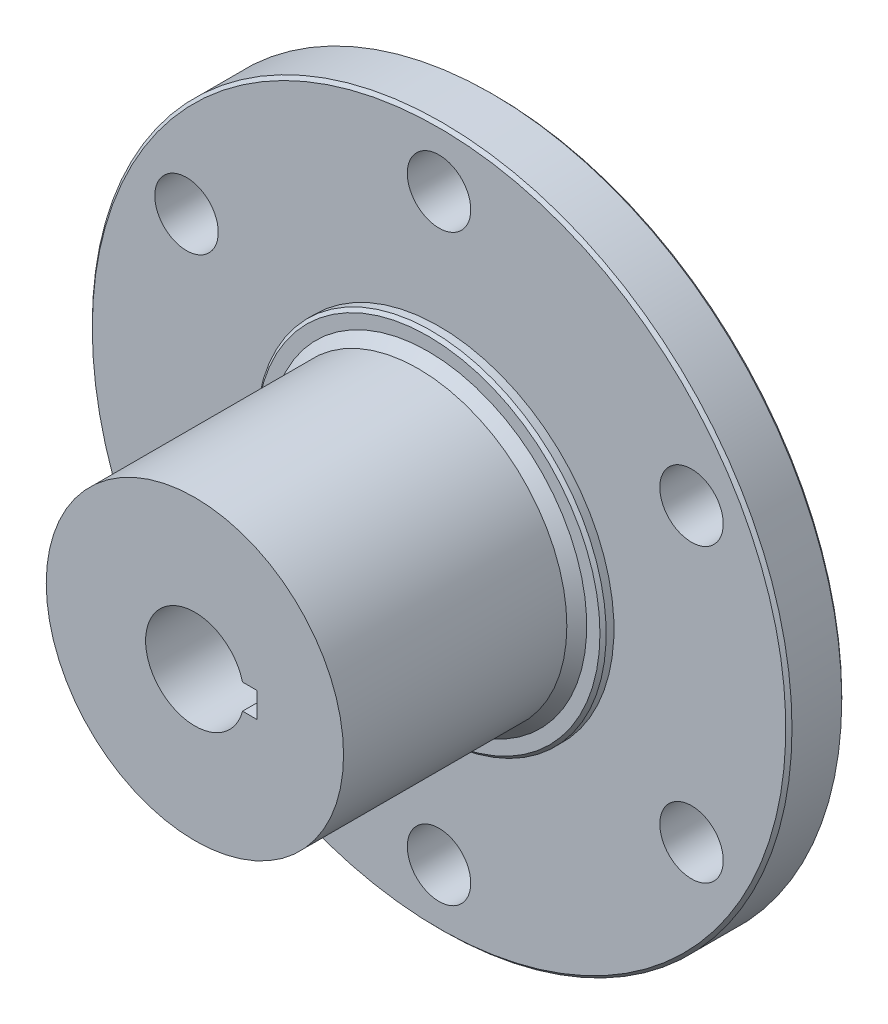
ISO-10303-21;
HEADER;
FILE_DESCRIPTION(('STEP AP214'),'2;1');
FILE_NAME('part.step','',(''),(''),'','','');
FILE_SCHEMA(('AUTOMOTIVE_DESIGN { 1 0 10303 214 1 1 1 1 }'));
ENDSEC;
DATA;
#1=APPLICATION_CONTEXT('core data for automotive mechanical design processes');
#2=APPLICATION_PROTOCOL_DEFINITION('international standard','automotive_design',2000,#1);
#3=PRODUCT_CONTEXT('',#1,'mechanical');
#4=PRODUCT('Part','Part','',(#3));
#5=PRODUCT_RELATED_PRODUCT_CATEGORY('part','',(#4));
#6=PRODUCT_DEFINITION_FORMATION('','',#4);
#7=PRODUCT_DEFINITION_CONTEXT('part definition',#1,'design');
#8=PRODUCT_DEFINITION('design','',#6,#7);
#9=PRODUCT_DEFINITION_SHAPE('','',#8);
#10=(LENGTH_UNIT() NAMED_UNIT(*) SI_UNIT(.MILLI.,.METRE.));
#11=(NAMED_UNIT(*) PLANE_ANGLE_UNIT() SI_UNIT($,.RADIAN.));
#12=(NAMED_UNIT(*) SI_UNIT($,.STERADIAN.) SOLID_ANGLE_UNIT());
#13=UNCERTAINTY_MEASURE_WITH_UNIT(LENGTH_MEASURE(1.E-05),#10,'distance_accuracy_value','');
#14=(GEOMETRIC_REPRESENTATION_CONTEXT(3) GLOBAL_UNCERTAINTY_ASSIGNED_CONTEXT((#13)) GLOBAL_UNIT_ASSIGNED_CONTEXT((#10,
#11,#12)) REPRESENTATION_CONTEXT('',''));
#15=CARTESIAN_POINT('',(0.,0.,0.));
#16=DIRECTION('',(0.,0.,1.));
#17=DIRECTION('',(1.,0.,0.));
#18=AXIS2_PLACEMENT_3D('',#15,#16,#17);
#19=CARTESIAN_POINT('',(3.89225476041844,-1.0287,0.));
#20=DIRECTION('',(0.,-1.,0.));
#21=DIRECTION('',(1.,0.,0.));
#22=AXIS2_PLACEMENT_3D('',#19,#20,#21);
#23=PLANE('',#22);
#24=DIRECTION('',(0.,0.,-1.));
#25=VECTOR('',#24,1.);
#26=CARTESIAN_POINT('',(5.0546,-1.0287,0.));
#27=LINE('',#26,#25);
#28=CARTESIAN_POINT('',(5.0546,-1.0287,25.4));
#29=VERTEX_POINT('',#28);
#30=CARTESIAN_POINT('',(5.0546,-1.0287,0.));
#31=VERTEX_POINT('',#30);
#32=EDGE_CURVE('E78',#29,#31,#27,.T.);
#33=ORIENTED_EDGE('',*,*,#32,.T.);
#34=DIRECTION('',(1.,0.,0.));
#35=VECTOR('',#34,1.);
#36=CARTESIAN_POINT('',(3.89225476041844,-1.0287,0.));
#37=LINE('',#36,#35);
#38=CARTESIAN_POINT('',(3.89225476041844,-1.0287,0.));
#39=VERTEX_POINT('',#38);
#40=EDGE_CURVE('E35',#39,#31,#37,.T.);
#41=ORIENTED_EDGE('',*,*,#40,.F.);
#42=DIRECTION('',(0.,0.,1.));
#43=VECTOR('',#42,1.);
#44=CARTESIAN_POINT('',(3.89225476041844,-1.0287,0.));
#45=LINE('',#44,#43);
#46=CARTESIAN_POINT('',(3.89225476041844,-1.0287,25.4));
#47=VERTEX_POINT('',#46);
#48=EDGE_CURVE('E67',#39,#47,#45,.T.);
#49=ORIENTED_EDGE('',*,*,#48,.T.);
#50=DIRECTION('',(1.,0.,0.));
#51=VECTOR('',#50,1.);
#52=CARTESIAN_POINT('',(0.,-1.0287,25.4));
#53=LINE('',#52,#51);
#54=EDGE_CURVE('E53',#29,#47,#53,.F.);
#55=ORIENTED_EDGE('',*,*,#54,.F.);
#56=EDGE_LOOP('',(#33,#41,#49,#55));
#57=FACE_BOUND('',#56,.T.);
#58=ADVANCED_FACE('F17',(#57),#23,.F.);
#59=CARTESIAN_POINT('',(3.89225476041844,1.0287,0.));
#60=DIRECTION('',(0.,1.,0.));
#61=DIRECTION('',(0.,0.,1.));
#62=AXIS2_PLACEMENT_3D('',#59,#60,#61);
#63=PLANE('',#62);
#64=DIRECTION('',(0.,0.,1.));
#65=VECTOR('',#64,1.);
#66=CARTESIAN_POINT('',(3.89225476041844,1.0287,0.));
#67=LINE('',#66,#65);
#68=CARTESIAN_POINT('',(3.89225476041844,1.0287,25.4));
#69=VERTEX_POINT('',#68);
#70=CARTESIAN_POINT('',(3.89225476041844,1.0287,0.));
#71=VERTEX_POINT('',#70);
#72=EDGE_CURVE('E60',#69,#71,#67,.F.);
#73=ORIENTED_EDGE('',*,*,#72,.T.);
#74=DIRECTION('',(1.,0.,0.));
#75=VECTOR('',#74,1.);
#76=CARTESIAN_POINT('',(3.89225476041844,1.0287,0.));
#77=LINE('',#76,#75);
#78=CARTESIAN_POINT('',(5.0546,1.0287,0.));
#79=VERTEX_POINT('',#78);
#80=EDGE_CURVE('E87',#79,#71,#77,.F.);
#81=ORIENTED_EDGE('',*,*,#80,.F.);
#82=DIRECTION('',(0.,0.,-1.));
#83=VECTOR('',#82,1.);
#84=CARTESIAN_POINT('',(5.0546,1.0287,0.));
#85=LINE('',#84,#83);
#86=CARTESIAN_POINT('',(5.0546,1.0287,25.4));
#87=VERTEX_POINT('',#86);
#88=EDGE_CURVE('E74',#79,#87,#85,.F.);
#89=ORIENTED_EDGE('',*,*,#88,.T.);
#90=DIRECTION('',(1.,0.,0.));
#91=VECTOR('',#90,1.);
#92=CARTESIAN_POINT('',(0.,1.0287,25.4));
#93=LINE('',#92,#91);
#94=EDGE_CURVE('E68',#69,#87,#93,.T.);
#95=ORIENTED_EDGE('',*,*,#94,.F.);
#96=EDGE_LOOP('',(#73,#81,#89,#95));
#97=FACE_BOUND('',#96,.T.);
#98=ADVANCED_FACE('F72',(#97),#63,.F.);
#99=CARTESIAN_POINT('',(0.,0.,25.4));
#100=DIRECTION('',(0.,0.,1.));
#101=DIRECTION('',(1.,0.,0.));
#102=AXIS2_PLACEMENT_3D('',#99,#100,#101);
#103=PLANE('',#102);
#104=CARTESIAN_POINT('',(0.,0.,25.4));
#105=DIRECTION('',(0.,0.,-1.));
#106=DIRECTION('',(-1.,0.,0.));
#107=AXIS2_PLACEMENT_3D('',#104,#105,#106);
#108=CIRCLE('',#107,12.1412);
#109=CARTESIAN_POINT('',(-12.1412,0.,25.4));
#110=VERTEX_POINT('',#109);
#111=EDGE_CURVE('E98',#110,#110,#108,.T.);
#112=ORIENTED_EDGE('',*,*,#111,.F.);
#113=EDGE_LOOP('',(#112));
#114=FACE_BOUND('',#113,.T.);
#115=CARTESIAN_POINT('',(0.,0.,25.4));
#116=DIRECTION('',(0.,0.,1.));
#117=DIRECTION('',(1.,0.,0.));
#118=AXIS2_PLACEMENT_3D('',#115,#116,#117);
#119=CIRCLE('',#118,4.0259);
#120=EDGE_CURVE('E20',#47,#69,#119,.F.);
#121=ORIENTED_EDGE('',*,*,#120,.T.);
#122=ORIENTED_EDGE('',*,*,#94,.T.);
#123=DIRECTION('',(0.,1.,0.));
#124=VECTOR('',#123,1.);
#125=CARTESIAN_POINT('',(5.0546,1.0287,25.4));
#126=LINE('',#125,#124);
#127=EDGE_CURVE('E96',#87,#29,#126,.F.);
#128=ORIENTED_EDGE('',*,*,#127,.T.);
#129=ORIENTED_EDGE('',*,*,#54,.T.);
#130=EDGE_LOOP('',(#121,#122,#128,#129));
#131=FACE_BOUND('',#130,.T.);
#132=ADVANCED_FACE('F77',(#114,#131),#103,.T.);
#133=CARTESIAN_POINT('',(0.,0.,0.));
#134=DIRECTION('',(0.,0.,1.));
#135=DIRECTION('',(1.,0.,0.));
#136=AXIS2_PLACEMENT_3D('',#133,#134,#135);
#137=CYLINDRICAL_SURFACE('',#136,4.0259);
#138=ORIENTED_EDGE('',*,*,#48,.F.);
#139=CARTESIAN_POINT('',(0.,0.,0.));
#140=DIRECTION('',(0.,0.,1.));
#141=DIRECTION('',(1.,0.,0.));
#142=AXIS2_PLACEMENT_3D('',#139,#140,#141);
#143=CIRCLE('',#142,4.0259);
#144=EDGE_CURVE('E65',#39,#71,#143,.F.);
#145=ORIENTED_EDGE('',*,*,#144,.T.);
#146=ORIENTED_EDGE('',*,*,#72,.F.);
#147=ORIENTED_EDGE('',*,*,#120,.F.);
#148=EDGE_LOOP('',(#138,#145,#146,#147));
#149=FACE_BOUND('',#148,.T.);
#150=ADVANCED_FACE('F63',(#149),#137,.F.);
#151=CARTESIAN_POINT('',(5.0546,1.0287,0.));
#152=DIRECTION('',(1.,0.,0.));
#153=DIRECTION('',(0.,0.,-1.));
#154=AXIS2_PLACEMENT_3D('',#151,#152,#153);
#155=PLANE('',#154);
#156=ORIENTED_EDGE('',*,*,#88,.F.);
#157=DIRECTION('',(0.,1.,0.));
#158=VECTOR('',#157,1.);
#159=CARTESIAN_POINT('',(5.0546,0.,0.));
#160=LINE('',#159,#158);
#161=EDGE_CURVE('E106',#79,#31,#160,.F.);
#162=ORIENTED_EDGE('',*,*,#161,.T.);
#163=ORIENTED_EDGE('',*,*,#32,.F.);
#164=ORIENTED_EDGE('',*,*,#127,.F.);
#165=EDGE_LOOP('',(#156,#162,#163,#164));
#166=FACE_BOUND('',#165,.T.);
#167=ADVANCED_FACE('F182',(#166),#155,.F.);
#168=CARTESIAN_POINT('',(0.,0.,25.4));
#169=DIRECTION('',(0.,0.,-1.));
#170=DIRECTION('',(-1.,0.,0.));
#171=AXIS2_PLACEMENT_3D('',#168,#169,#170);
#172=CYLINDRICAL_SURFACE('',#171,12.1412);
#173=ORIENTED_EDGE('',*,*,#111,.T.);
#174=EDGE_LOOP('',(#173));
#175=FACE_BOUND('',#174,.T.);
#176=CARTESIAN_POINT('',(0.,0.,7.16280000000005));
#177=DIRECTION('',(0.,0.,-1.));
#178=DIRECTION('',(-1.,0.,0.));
#179=AXIS2_PLACEMENT_3D('',#176,#177,#178);
#180=CIRCLE('',#179,12.1412);
#181=CARTESIAN_POINT('',(-12.1412,0.,7.16280000000005));
#182=VERTEX_POINT('',#181);
#183=EDGE_CURVE('E109',#182,#182,#180,.T.);
#184=ORIENTED_EDGE('',*,*,#183,.F.);
#185=EDGE_LOOP('',(#184));
#186=FACE_BOUND('',#185,.T.);
#187=ADVANCED_FACE('F172',(#175,#186),#172,.T.);
#188=CARTESIAN_POINT('',(0.,0.,0.));
#189=DIRECTION('',(0.,0.,1.));
#190=DIRECTION('',(1.,0.,0.));
#191=AXIS2_PLACEMENT_3D('',#188,#189,#190);
#192=PLANE('',#191);
#193=ORIENTED_EDGE('',*,*,#161,.F.);
#194=ORIENTED_EDGE('',*,*,#80,.T.);
#195=ORIENTED_EDGE('',*,*,#144,.F.);
#196=ORIENTED_EDGE('',*,*,#40,.T.);
#197=EDGE_LOOP('',(#193,#194,#195,#196));
#198=FACE_BOUND('',#197,.T.);
#199=CARTESIAN_POINT('',(0.,0.,0.));
#200=DIRECTION('',(0.,0.,1.));
#201=DIRECTION('',(0.,-1.,0.));
#202=AXIS2_PLACEMENT_3D('',#199,#200,#201);
#203=CIRCLE('',#202,14.1003226197908);
#204=CARTESIAN_POINT('',(0.,-14.1003226197908,0.));
#205=VERTEX_POINT('',#204);
#206=EDGE_CURVE('E166',#205,#205,#203,.T.);
#207=ORIENTED_EDGE('',*,*,#206,.F.);
#208=EDGE_LOOP('',(#207));
#209=FACE_BOUND('',#208,.T.);
#210=ADVANCED_FACE('F256',(#198,#209),#192,.F.);
#211=CARTESIAN_POINT('',(0.,0.,6.35));
#212=DIRECTION('',(0.,0.,-1.));
#213=DIRECTION('',(0.,1.,0.));
#214=AXIS2_PLACEMENT_3D('',#211,#212,#213);
#215=CONICAL_SURFACE('',#214,12.954,0.785398163397445);
#216=ORIENTED_EDGE('',*,*,#183,.T.);
#217=EDGE_LOOP('',(#216));
#218=FACE_BOUND('',#217,.T.);
#219=CARTESIAN_POINT('',(0.,0.,6.35));
#220=DIRECTION('',(0.,0.,-1.));
#221=DIRECTION('',(0.,1.,0.));
#222=AXIS2_PLACEMENT_3D('',#219,#220,#221);
#223=CIRCLE('',#222,12.954);
#224=CARTESIAN_POINT('',(0.,12.954,6.35));
#225=VERTEX_POINT('',#224);
#226=EDGE_CURVE('E162',#225,#225,#223,.T.);
#227=ORIENTED_EDGE('',*,*,#226,.F.);
#228=EDGE_LOOP('',(#227));
#229=FACE_BOUND('',#228,.T.);
#230=ADVANCED_FACE('F252',(#218,#229),#215,.T.);
#231=CARTESIAN_POINT('',(0.,0.,0.254000000000009));
#232=DIRECTION('',(0.,0.,1.));
#233=DIRECTION('',(0.,-1.,0.));
#234=AXIS2_PLACEMENT_3D('',#231,#232,#233);
#235=CONICAL_SURFACE('',#234,14.3543226197908,0.785398163397449);
#236=ORIENTED_EDGE('',*,*,#206,.T.);
#237=EDGE_LOOP('',(#236));
#238=FACE_BOUND('',#237,.T.);
#239=CARTESIAN_POINT('',(0.,0.,0.254000000000009));
#240=DIRECTION('',(0.,0.,-1.));
#241=DIRECTION('',(-1.,0.,0.));
#242=AXIS2_PLACEMENT_3D('',#239,#240,#241);
#243=CIRCLE('',#242,14.3543226197908);
#244=CARTESIAN_POINT('',(-14.3543226197908,0.,0.254000000000009));
#245=VERTEX_POINT('',#244);
#246=EDGE_CURVE('E165',#245,#245,#243,.F.);
#247=ORIENTED_EDGE('',*,*,#246,.F.);
#248=EDGE_LOOP('',(#247));
#249=FACE_BOUND('',#248,.T.);
#250=ADVANCED_FACE('F248',(#238,#249),#235,.T.);
#251=CARTESIAN_POINT('',(0.,0.,6.35));
#252=DIRECTION('',(0.,0.,1.));
#253=DIRECTION('',(1.,0.,0.));
#254=AXIS2_PLACEMENT_3D('',#251,#252,#253);
#255=PLANE('',#254);
#256=CARTESIAN_POINT('',(0.,0.,6.35));
#257=DIRECTION('',(0.,0.,-1.));
#258=DIRECTION('',(-1.,0.,0.));
#259=AXIS2_PLACEMENT_3D('',#256,#257,#258);
#260=CIRCLE('',#259,14.0335);
#261=CARTESIAN_POINT('',(-14.0335,0.,6.35));
#262=VERTEX_POINT('',#261);
#263=EDGE_CURVE('E158',#262,#262,#260,.T.);
#264=ORIENTED_EDGE('',*,*,#263,.F.);
#265=EDGE_LOOP('',(#264));
#266=FACE_BOUND('',#265,.T.);
#267=ORIENTED_EDGE('',*,*,#226,.T.);
#268=EDGE_LOOP('',(#267));
#269=FACE_BOUND('',#268,.T.);
#270=ADVANCED_FACE('F244',(#266,#269),#255,.T.);
#271=CARTESIAN_POINT('',(0.,0.,1.143));
#272=DIRECTION('',(0.,0.,1.));
#273=DIRECTION('',(1.,0.,0.));
#274=AXIS2_PLACEMENT_3D('',#271,#272,#273);
#275=CONICAL_SURFACE('',#274,28.575,0.785398163397457);
#276=CARTESIAN_POINT('',(0.,0.,1.14299999999999));
#277=DIRECTION('',(0.,0.,-1.));
#278=DIRECTION('',(-1.,0.,0.));
#279=AXIS2_PLACEMENT_3D('',#276,#277,#278);
#280=CIRCLE('',#279,28.575);
#281=CARTESIAN_POINT('',(-28.575,0.,1.14299999999999));
#282=VERTEX_POINT('',#281);
#283=EDGE_CURVE('E161',#282,#282,#280,.F.);
#284=ORIENTED_EDGE('',*,*,#283,.F.);
#285=EDGE_LOOP('',(#284));
#286=FACE_BOUND('',#285,.T.);
#287=CARTESIAN_POINT('',(0.,0.,0.889000000000003));
#288=DIRECTION('',(0.,0.,1.));
#289=DIRECTION('',(1.,0.,0.));
#290=AXIS2_PLACEMENT_3D('',#287,#288,#289);
#291=CIRCLE('',#290,28.321);
#292=CARTESIAN_POINT('',(28.321,0.,0.889000000000003));
#293=VERTEX_POINT('',#292);
#294=EDGE_CURVE('E155',#293,#293,#291,.F.);
#295=ORIENTED_EDGE('',*,*,#294,.F.);
#296=EDGE_LOOP('',(#295));
#297=FACE_BOUND('',#296,.T.);
#298=ADVANCED_FACE('F240',(#286,#297),#275,.T.);
#299=CARTESIAN_POINT('',(0.,0.,0.));
#300=DIRECTION('',(0.,0.,-1.));
#301=DIRECTION('',(-1.,0.,0.));
#302=AXIS2_PLACEMENT_3D('',#299,#300,#301);
#303=CYLINDRICAL_SURFACE('',#302,14.3543226197908);
#304=CARTESIAN_POINT('',(0.,0.,0.889000000000001));
#305=DIRECTION('',(0.,0.,-1.));
#306=DIRECTION('',(-1.,0.,0.));
#307=AXIS2_PLACEMENT_3D('',#304,#305,#306);
#308=CIRCLE('',#307,14.3543226197908);
#309=CARTESIAN_POINT('',(-14.3543226197908,0.,0.889000000000001));
#310=VERTEX_POINT('',#309);
#311=EDGE_CURVE('E152',#310,#310,#308,.F.);
#312=ORIENTED_EDGE('',*,*,#311,.F.);
#313=EDGE_LOOP('',(#312));
#314=FACE_BOUND('',#313,.T.);
#315=ORIENTED_EDGE('',*,*,#246,.T.);
#316=EDGE_LOOP('',(#315));
#317=FACE_BOUND('',#316,.T.);
#318=ADVANCED_FACE('F236',(#314,#317),#303,.T.);
#319=CARTESIAN_POINT('',(0.,0.,6.35));
#320=DIRECTION('',(0.,0.,-1.));
#321=DIRECTION('',(-1.,0.,0.));
#322=AXIS2_PLACEMENT_3D('',#319,#320,#321);
#323=CYLINDRICAL_SURFACE('',#322,28.575);
#324=CARTESIAN_POINT('',(0.,0.,5.20699999999999));
#325=DIRECTION('',(0.,0.,-1.));
#326=DIRECTION('',(-1.,0.,0.));
#327=AXIS2_PLACEMENT_3D('',#324,#325,#326);
#328=CIRCLE('',#327,28.575);
#329=CARTESIAN_POINT('',(-28.575,0.,5.20699999999999));
#330=VERTEX_POINT('',#329);
#331=EDGE_CURVE('E151',#330,#330,#328,.F.);
#332=ORIENTED_EDGE('',*,*,#331,.F.);
#333=EDGE_LOOP('',(#332));
#334=FACE_BOUND('',#333,.T.);
#335=ORIENTED_EDGE('',*,*,#283,.T.);
#336=EDGE_LOOP('',(#335));
#337=FACE_BOUND('',#336,.T.);
#338=ADVANCED_FACE('F232',(#334,#337),#323,.T.);
#339=CARTESIAN_POINT('',(0.,0.,6.09599999999999));
#340=DIRECTION('',(0.,0.,-1.));
#341=DIRECTION('',(-1.,0.,0.));
#342=AXIS2_PLACEMENT_3D('',#339,#340,#341);
#343=CONICAL_SURFACE('',#342,14.2875,0.785398163397421);
#344=CARTESIAN_POINT('',(0.,0.,6.09599999999999));
#345=DIRECTION('',(0.,0.,-1.));
#346=DIRECTION('',(-1.,0.,0.));
#347=AXIS2_PLACEMENT_3D('',#344,#345,#346);
#348=CIRCLE('',#347,14.2875);
#349=CARTESIAN_POINT('',(-14.2875,0.,6.09599999999999));
#350=VERTEX_POINT('',#349);
#351=EDGE_CURVE('E141',#350,#350,#348,.T.);
#352=ORIENTED_EDGE('',*,*,#351,.F.);
#353=EDGE_LOOP('',(#352));
#354=FACE_BOUND('',#353,.T.);
#355=ORIENTED_EDGE('',*,*,#263,.T.);
#356=EDGE_LOOP('',(#355));
#357=FACE_BOUND('',#356,.T.);
#358=ADVANCED_FACE('F228',(#354,#357),#343,.T.);
#359=CARTESIAN_POINT('',(-62.1712615480534,0.,0.889000000000003));
#360=DIRECTION('',(0.,0.,-1.));
#361=DIRECTION('',(-1.,0.,0.));
#362=AXIS2_PLACEMENT_3D('',#359,#360,#361);
#363=PLANE('',#362);
#364=CARTESIAN_POINT('',(-20.622229927617,11.90625,0.889000000000001));
#365=DIRECTION('',(0.,0.,1.));
#366=DIRECTION('',(1.,0.,0.));
#367=AXIS2_PLACEMENT_3D('',#364,#365,#366);
#368=CIRCLE('',#367,2.5908);
#369=CARTESIAN_POINT('',(-18.031429927617,11.90625,0.889000000000001));
#370=VERTEX_POINT('',#369);
#371=EDGE_CURVE('E132',#370,#370,#368,.T.);
#372=ORIENTED_EDGE('',*,*,#371,.T.);
#373=EDGE_LOOP('',(#372));
#374=FACE_BOUND('',#373,.T.);
#375=CARTESIAN_POINT('',(0.,-23.8125,0.889000000000003));
#376=DIRECTION('',(0.,0.,1.));
#377=DIRECTION('',(1.,0.,0.));
#378=AXIS2_PLACEMENT_3D('',#375,#376,#377);
#379=CIRCLE('',#378,2.5908);
#380=CARTESIAN_POINT('',(2.5908,-23.8125,0.889000000000003));
#381=VERTEX_POINT('',#380);
#382=EDGE_CURVE('E135',#381,#381,#379,.T.);
#383=ORIENTED_EDGE('',*,*,#382,.T.);
#384=EDGE_LOOP('',(#383));
#385=FACE_BOUND('',#384,.T.);
#386=CARTESIAN_POINT('',(20.6222299276168,11.9062500000002,0.889000000000004));
#387=DIRECTION('',(0.,0.,1.));
#388=DIRECTION('',(1.,0.,0.));
#389=AXIS2_PLACEMENT_3D('',#386,#387,#388);
#390=CIRCLE('',#389,2.5908);
#391=CARTESIAN_POINT('',(23.2130299276168,11.9062500000002,0.889000000000004));
#392=VERTEX_POINT('',#391);
#393=EDGE_CURVE('E138',#392,#392,#390,.T.);
#394=ORIENTED_EDGE('',*,*,#393,.T.);
#395=EDGE_LOOP('',(#394));
#396=FACE_BOUND('',#395,.T.);
#397=ORIENTED_EDGE('',*,*,#311,.T.);
#398=EDGE_LOOP('',(#397));
#399=FACE_BOUND('',#398,.T.);
#400=CARTESIAN_POINT('',(20.6222299276171,-11.9062499999998,0.889000000000004));
#401=DIRECTION('',(0.,0.,1.));
#402=DIRECTION('',(1.,0.,0.));
#403=AXIS2_PLACEMENT_3D('',#400,#401,#402);
#404=CIRCLE('',#403,2.5908);
#405=CARTESIAN_POINT('',(23.2130299276171,-11.9062499999998,0.889000000000004));
#406=VERTEX_POINT('',#405);
#407=EDGE_CURVE('E142',#406,#406,#404,.T.);
#408=ORIENTED_EDGE('',*,*,#407,.T.);
#409=EDGE_LOOP('',(#408));
#410=FACE_BOUND('',#409,.T.);
#411=CARTESIAN_POINT('',(-20.6222299276169,-11.9062500000001,0.889000000000001));
#412=DIRECTION('',(0.,0.,1.));
#413=DIRECTION('',(1.,0.,0.));
#414=AXIS2_PLACEMENT_3D('',#411,#412,#413);
#415=CIRCLE('',#414,2.5908);
#416=CARTESIAN_POINT('',(-18.0314299276169,-11.9062500000001,0.889000000000001));
#417=VERTEX_POINT('',#416);
#418=EDGE_CURVE('E145',#417,#417,#415,.T.);
#419=ORIENTED_EDGE('',*,*,#418,.T.);
#420=EDGE_LOOP('',(#419));
#421=FACE_BOUND('',#420,.T.);
#422=CARTESIAN_POINT('',(0.,23.8125,0.889000000000003));
#423=DIRECTION('',(0.,0.,1.));
#424=DIRECTION('',(1.,0.,0.));
#425=AXIS2_PLACEMENT_3D('',#422,#423,#424);
#426=CIRCLE('',#425,2.5908);
#427=CARTESIAN_POINT('',(2.5908,23.8125,0.889000000000003));
#428=VERTEX_POINT('',#427);
#429=EDGE_CURVE('E148',#428,#428,#426,.T.);
#430=ORIENTED_EDGE('',*,*,#429,.T.);
#431=EDGE_LOOP('',(#430));
#432=FACE_BOUND('',#431,.T.);
#433=ORIENTED_EDGE('',*,*,#294,.T.);
#434=EDGE_LOOP('',(#433));
#435=FACE_BOUND('',#434,.T.);
#436=ADVANCED_FACE('F224',(#374,#385,#396,#399,#410,#421,#432,#435),#363,.T.);
#437=CARTESIAN_POINT('',(0.,0.,5.20699999999999));
#438=DIRECTION('',(0.,0.,-1.));
#439=DIRECTION('',(-1.,0.,0.));
#440=AXIS2_PLACEMENT_3D('',#437,#438,#439);
#441=CONICAL_SURFACE('',#440,28.575,0.785398163397457);
#442=CARTESIAN_POINT('',(0.,0.,5.461));
#443=DIRECTION('',(0.,0.,-1.));
#444=DIRECTION('',(-1.,0.,0.));
#445=AXIS2_PLACEMENT_3D('',#442,#443,#444);
#446=CIRCLE('',#445,28.321);
#447=CARTESIAN_POINT('',(-28.321,0.,5.461));
#448=VERTEX_POINT('',#447);
#449=EDGE_CURVE('E129',#448,#448,#446,.T.);
#450=ORIENTED_EDGE('',*,*,#449,.T.);
#451=EDGE_LOOP('',(#450));
#452=FACE_BOUND('',#451,.T.);
#453=ORIENTED_EDGE('',*,*,#331,.T.);
#454=EDGE_LOOP('',(#453));
#455=FACE_BOUND('',#454,.T.);
#456=ADVANCED_FACE('F220',(#452,#455),#441,.T.);
#457=CARTESIAN_POINT('',(0.,23.8125,0.));
#458=DIRECTION('',(0.,0.,1.));
#459=DIRECTION('',(1.,0.,0.));
#460=AXIS2_PLACEMENT_3D('',#457,#458,#459);
#461=CYLINDRICAL_SURFACE('',#460,2.5908);
#462=ORIENTED_EDGE('',*,*,#429,.F.);
#463=EDGE_LOOP('',(#462));
#464=FACE_BOUND('',#463,.T.);
#465=CARTESIAN_POINT('',(0.,23.8125,5.461));
#466=DIRECTION('',(0.,0.,1.));
#467=DIRECTION('',(1.,0.,0.));
#468=AXIS2_PLACEMENT_3D('',#465,#466,#467);
#469=CIRCLE('',#468,2.5908);
#470=CARTESIAN_POINT('',(2.5908,23.8125,5.461));
#471=VERTEX_POINT('',#470);
#472=EDGE_CURVE('E126',#471,#471,#469,.T.);
#473=ORIENTED_EDGE('',*,*,#472,.T.);
#474=EDGE_LOOP('',(#473));
#475=FACE_BOUND('',#474,.T.);
#476=ADVANCED_FACE('F216',(#464,#475),#461,.F.);
#477=CARTESIAN_POINT('',(-20.6222299276169,-11.9062500000001,0.));
#478=DIRECTION('',(0.,0.,1.));
#479=DIRECTION('',(1.,0.,0.));
#480=AXIS2_PLACEMENT_3D('',#477,#478,#479);
#481=CYLINDRICAL_SURFACE('',#480,2.5908);
#482=ORIENTED_EDGE('',*,*,#418,.F.);
#483=EDGE_LOOP('',(#482));
#484=FACE_BOUND('',#483,.T.);
#485=CARTESIAN_POINT('',(-20.6222299276169,-11.9062500000001,5.461));
#486=DIRECTION('',(0.,0.,1.));
#487=DIRECTION('',(1.,0.,0.));
#488=AXIS2_PLACEMENT_3D('',#485,#486,#487);
#489=CIRCLE('',#488,2.5908);
#490=CARTESIAN_POINT('',(-18.0314299276169,-11.9062500000001,5.461));
#491=VERTEX_POINT('',#490);
#492=EDGE_CURVE('E123',#491,#491,#489,.T.);
#493=ORIENTED_EDGE('',*,*,#492,.T.);
#494=EDGE_LOOP('',(#493));
#495=FACE_BOUND('',#494,.T.);
#496=ADVANCED_FACE('F212',(#484,#495),#481,.F.);
#497=CARTESIAN_POINT('',(20.6222299276171,-11.9062499999998,0.));
#498=DIRECTION('',(0.,0.,1.));
#499=DIRECTION('',(1.,0.,0.));
#500=AXIS2_PLACEMENT_3D('',#497,#498,#499);
#501=CYLINDRICAL_SURFACE('',#500,2.5908);
#502=ORIENTED_EDGE('',*,*,#407,.F.);
#503=EDGE_LOOP('',(#502));
#504=FACE_BOUND('',#503,.T.);
#505=CARTESIAN_POINT('',(20.6222299276171,-11.9062499999998,5.461));
#506=DIRECTION('',(0.,0.,1.));
#507=DIRECTION('',(1.,0.,0.));
#508=AXIS2_PLACEMENT_3D('',#505,#506,#507);
#509=CIRCLE('',#508,2.5908);
#510=CARTESIAN_POINT('',(23.2130299276171,-11.9062499999998,5.461));
#511=VERTEX_POINT('',#510);
#512=EDGE_CURVE('E120',#511,#511,#509,.T.);
#513=ORIENTED_EDGE('',*,*,#512,.T.);
#514=EDGE_LOOP('',(#513));
#515=FACE_BOUND('',#514,.T.);
#516=ADVANCED_FACE('F208',(#504,#515),#501,.F.);
#517=CARTESIAN_POINT('',(0.,0.,0.));
#518=DIRECTION('',(0.,0.,-1.));
#519=DIRECTION('',(-1.,0.,0.));
#520=AXIS2_PLACEMENT_3D('',#517,#518,#519);
#521=CYLINDRICAL_SURFACE('',#520,14.2875);
#522=CARTESIAN_POINT('',(0.,0.,5.461));
#523=DIRECTION('',(0.,0.,-1.));
#524=DIRECTION('',(-1.,0.,0.));
#525=AXIS2_PLACEMENT_3D('',#522,#523,#524);
#526=CIRCLE('',#525,14.2875);
#527=CARTESIAN_POINT('',(-14.2875,0.,5.461));
#528=VERTEX_POINT('',#527);
#529=EDGE_CURVE('E117',#528,#528,#526,.F.);
#530=ORIENTED_EDGE('',*,*,#529,.T.);
#531=EDGE_LOOP('',(#530));
#532=FACE_BOUND('',#531,.T.);
#533=ORIENTED_EDGE('',*,*,#351,.T.);
#534=EDGE_LOOP('',(#533));
#535=FACE_BOUND('',#534,.T.);
#536=ADVANCED_FACE('F204',(#532,#535),#521,.T.);
#537=CARTESIAN_POINT('',(20.6222299276168,11.9062500000002,0.));
#538=DIRECTION('',(0.,0.,1.));
#539=DIRECTION('',(1.,0.,0.));
#540=AXIS2_PLACEMENT_3D('',#537,#538,#539);
#541=CYLINDRICAL_SURFACE('',#540,2.5908);
#542=ORIENTED_EDGE('',*,*,#393,.F.);
#543=EDGE_LOOP('',(#542));
#544=FACE_BOUND('',#543,.T.);
#545=CARTESIAN_POINT('',(20.6222299276168,11.9062500000002,5.461));
#546=DIRECTION('',(0.,0.,1.));
#547=DIRECTION('',(1.,0.,0.));
#548=AXIS2_PLACEMENT_3D('',#545,#546,#547);
#549=CIRCLE('',#548,2.5908);
#550=CARTESIAN_POINT('',(23.2130299276168,11.9062500000002,5.461));
#551=VERTEX_POINT('',#550);
#552=EDGE_CURVE('E114',#551,#551,#549,.T.);
#553=ORIENTED_EDGE('',*,*,#552,.T.);
#554=EDGE_LOOP('',(#553));
#555=FACE_BOUND('',#554,.T.);
#556=ADVANCED_FACE('F200',(#544,#555),#541,.F.);
#557=CARTESIAN_POINT('',(0.,-23.8125,0.));
#558=DIRECTION('',(0.,0.,1.));
#559=DIRECTION('',(1.,0.,0.));
#560=AXIS2_PLACEMENT_3D('',#557,#558,#559);
#561=CYLINDRICAL_SURFACE('',#560,2.5908);
#562=ORIENTED_EDGE('',*,*,#382,.F.);
#563=EDGE_LOOP('',(#562));
#564=FACE_BOUND('',#563,.T.);
#565=CARTESIAN_POINT('',(0.,-23.8125,5.461));
#566=DIRECTION('',(0.,0.,1.));
#567=DIRECTION('',(1.,0.,0.));
#568=AXIS2_PLACEMENT_3D('',#565,#566,#567);
#569=CIRCLE('',#568,2.5908);
#570=CARTESIAN_POINT('',(2.5908,-23.8125,5.461));
#571=VERTEX_POINT('',#570);
#572=EDGE_CURVE('E26',#571,#571,#569,.T.);
#573=ORIENTED_EDGE('',*,*,#572,.T.);
#574=EDGE_LOOP('',(#573));
#575=FACE_BOUND('',#574,.T.);
#576=ADVANCED_FACE('F192',(#564,#575),#561,.F.);
#577=CARTESIAN_POINT('',(-20.622229927617,11.90625,0.));
#578=DIRECTION('',(0.,0.,1.));
#579=DIRECTION('',(1.,0.,0.));
#580=AXIS2_PLACEMENT_3D('',#577,#578,#579);
#581=CYLINDRICAL_SURFACE('',#580,2.5908);
#582=ORIENTED_EDGE('',*,*,#371,.F.);
#583=EDGE_LOOP('',(#582));
#584=FACE_BOUND('',#583,.T.);
#585=CARTESIAN_POINT('',(-20.622229927617,11.90625,5.461));
#586=DIRECTION('',(0.,0.,1.));
#587=DIRECTION('',(1.,0.,0.));
#588=AXIS2_PLACEMENT_3D('',#585,#586,#587);
#589=CIRCLE('',#588,2.5908);
#590=CARTESIAN_POINT('',(-18.031429927617,11.90625,5.461));
#591=VERTEX_POINT('',#590);
#592=EDGE_CURVE('E10',#591,#591,#589,.T.);
#593=ORIENTED_EDGE('',*,*,#592,.T.);
#594=EDGE_LOOP('',(#593));
#595=FACE_BOUND('',#594,.T.);
#596=ADVANCED_FACE('F186',(#584,#595),#581,.F.);
#597=CARTESIAN_POINT('',(-62.1712615480534,0.,5.461));
#598=DIRECTION('',(0.,0.,-1.));
#599=DIRECTION('',(-1.,0.,0.));
#600=AXIS2_PLACEMENT_3D('',#597,#598,#599);
#601=PLANE('',#600);
#602=ORIENTED_EDGE('',*,*,#592,.F.);
#603=EDGE_LOOP('',(#602));
#604=FACE_BOUND('',#603,.T.);
#605=ORIENTED_EDGE('',*,*,#572,.F.);
#606=EDGE_LOOP('',(#605));
#607=FACE_BOUND('',#606,.T.);
#608=ORIENTED_EDGE('',*,*,#552,.F.);
#609=EDGE_LOOP('',(#608));
#610=FACE_BOUND('',#609,.T.);
#611=ORIENTED_EDGE('',*,*,#529,.F.);
#612=EDGE_LOOP('',(#611));
#613=FACE_BOUND('',#612,.T.);
#614=ORIENTED_EDGE('',*,*,#512,.F.);
#615=EDGE_LOOP('',(#614));
#616=FACE_BOUND('',#615,.T.);
#617=ORIENTED_EDGE('',*,*,#492,.F.);
#618=EDGE_LOOP('',(#617));
#619=FACE_BOUND('',#618,.T.);
#620=ORIENTED_EDGE('',*,*,#472,.F.);
#621=EDGE_LOOP('',(#620));
#622=FACE_BOUND('',#621,.T.);
#623=ORIENTED_EDGE('',*,*,#449,.F.);
#624=EDGE_LOOP('',(#623));
#625=FACE_BOUND('',#624,.T.);
#626=ADVANCED_FACE('F184',(#604,#607,#610,#613,#616,#619,#622,#625),#601,.F.);
#627=CLOSED_SHELL('',(#58,#98,#132,#150,#167,#187,#210,#230,#250,#270,#298,#318,#338,#358,#436,
#456,#476,#496,#516,#536,#556,#576,#596,#626));
#628=MANIFOLD_SOLID_BREP('B1',#627);
#629=ADVANCED_BREP_SHAPE_REPRESENTATION('',(#18,#628),#14);
#630=SHAPE_DEFINITION_REPRESENTATION(#9,#629);
ENDSEC;
END-ISO-10303-21;
